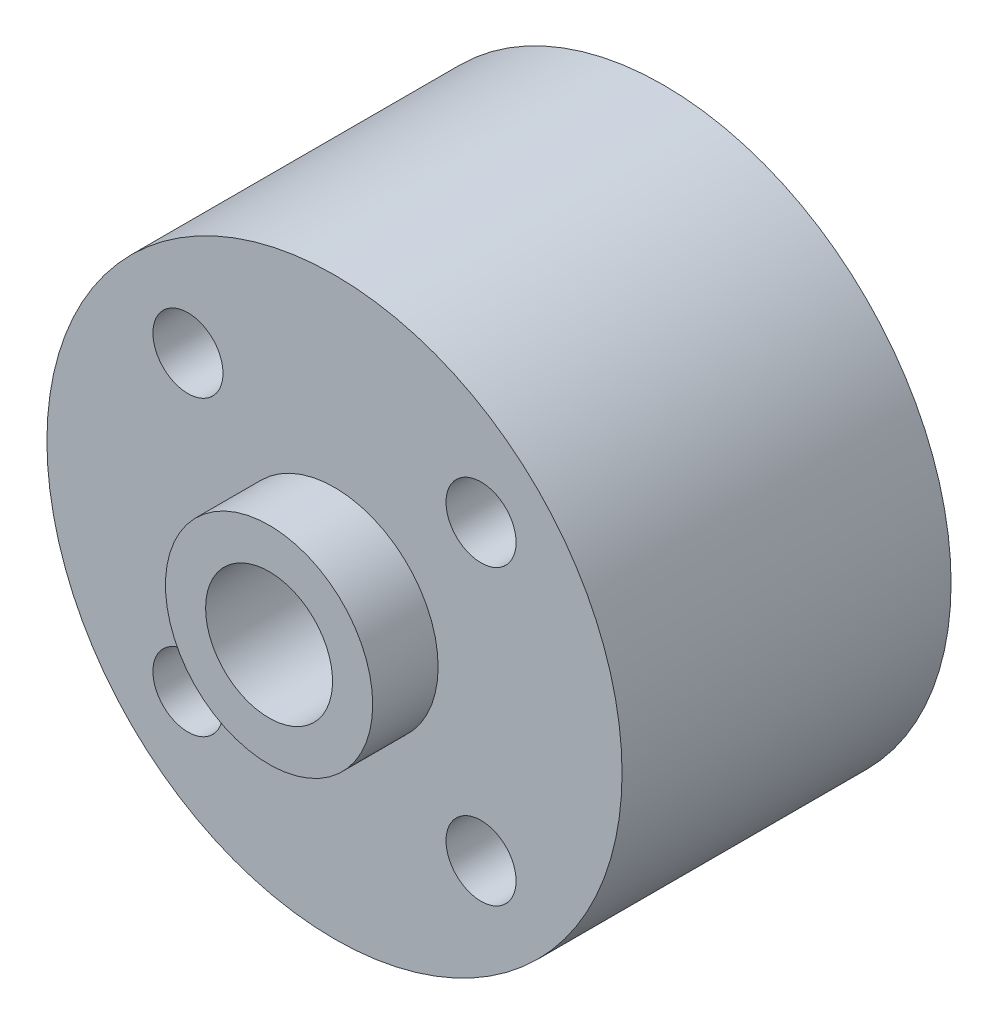
ISO-10303-21;
HEADER;
FILE_DESCRIPTION(('STEP AP214'),'2;1');
FILE_NAME('part.step','',(''),(''),'','','');
FILE_SCHEMA(('AUTOMOTIVE_DESIGN { 1 0 10303 214 1 1 1 1 }'));
ENDSEC;
DATA;
#1=APPLICATION_CONTEXT('core data for automotive mechanical design processes');
#2=APPLICATION_PROTOCOL_DEFINITION('international standard','automotive_design',2000,#1);
#3=PRODUCT_CONTEXT('',#1,'mechanical');
#4=PRODUCT('Part','Part','',(#3));
#5=PRODUCT_RELATED_PRODUCT_CATEGORY('part','',(#4));
#6=PRODUCT_DEFINITION_FORMATION('','',#4);
#7=PRODUCT_DEFINITION_CONTEXT('part definition',#1,'design');
#8=PRODUCT_DEFINITION('design','',#6,#7);
#9=PRODUCT_DEFINITION_SHAPE('','',#8);
#10=(LENGTH_UNIT() NAMED_UNIT(*) SI_UNIT(.MILLI.,.METRE.));
#11=(NAMED_UNIT(*) PLANE_ANGLE_UNIT() SI_UNIT($,.RADIAN.));
#12=(NAMED_UNIT(*) SI_UNIT($,.STERADIAN.) SOLID_ANGLE_UNIT());
#13=UNCERTAINTY_MEASURE_WITH_UNIT(LENGTH_MEASURE(1.E-05),#10,'distance_accuracy_value','');
#14=(GEOMETRIC_REPRESENTATION_CONTEXT(3) GLOBAL_UNCERTAINTY_ASSIGNED_CONTEXT((#13)) GLOBAL_UNIT_ASSIGNED_CONTEXT((#10,
#11,#12)) REPRESENTATION_CONTEXT('',''));
#15=CARTESIAN_POINT('',(0.,0.,0.));
#16=DIRECTION('',(0.,0.,1.));
#17=DIRECTION('',(1.,0.,0.));
#18=AXIS2_PLACEMENT_3D('',#15,#16,#17);
#19=CARTESIAN_POINT('',(0.,0.,10.65));
#20=DIRECTION('',(0.,0.,-1.));
#21=DIRECTION('',(-1.,0.,0.));
#22=AXIS2_PLACEMENT_3D('',#19,#20,#21);
#23=CYLINDRICAL_SURFACE('',#22,2.45);
#24=CARTESIAN_POINT('',(0.,0.,8.875));
#25=DIRECTION('',(0.,0.,-1.));
#26=DIRECTION('',(-1.,0.,0.));
#27=AXIS2_PLACEMENT_3D('',#24,#25,#26);
#28=CIRCLE('',#27,2.45);
#29=CARTESIAN_POINT('',(-2.45,0.,8.875));
#30=VERTEX_POINT('',#29);
#31=EDGE_CURVE('E62',#30,#30,#28,.T.);
#32=ORIENTED_EDGE('',*,*,#31,.F.);
#33=EDGE_LOOP('',(#32));
#34=FACE_BOUND('',#33,.T.);
#35=CARTESIAN_POINT('',(0.,0.,-8.875));
#36=DIRECTION('',(0.,0.,-1.));
#37=DIRECTION('',(-1.,0.,0.));
#38=AXIS2_PLACEMENT_3D('',#35,#36,#37);
#39=CIRCLE('',#38,2.45);
#40=CARTESIAN_POINT('',(-2.45,0.,-8.875));
#41=VERTEX_POINT('',#40);
#42=EDGE_CURVE('E16',#41,#41,#39,.T.);
#43=ORIENTED_EDGE('',*,*,#42,.T.);
#44=EDGE_LOOP('',(#43));
#45=FACE_BOUND('',#44,.T.);
#46=ADVANCED_FACE('F13',(#34,#45),#23,.F.);
#47=CARTESIAN_POINT('',(0.,0.,-8.875));
#48=DIRECTION('',(0.,0.,1.));
#49=DIRECTION('',(1.,0.,0.));
#50=AXIS2_PLACEMENT_3D('',#47,#48,#49);
#51=PLANE('',#50);
#52=ORIENTED_EDGE('',*,*,#42,.F.);
#53=EDGE_LOOP('',(#52));
#54=FACE_BOUND('',#53,.T.);
#55=CARTESIAN_POINT('',(0.,0.,-8.875));
#56=DIRECTION('',(0.,0.,1.));
#57=DIRECTION('',(1.,0.,0.));
#58=AXIS2_PLACEMENT_3D('',#55,#56,#57);
#59=CIRCLE('',#58,4.);
#60=CARTESIAN_POINT('',(4.,0.,-8.875));
#61=VERTEX_POINT('',#60);
#62=EDGE_CURVE('E60',#61,#61,#59,.T.);
#63=ORIENTED_EDGE('',*,*,#62,.F.);
#64=EDGE_LOOP('',(#63));
#65=FACE_BOUND('',#64,.T.);
#66=ADVANCED_FACE('F70',(#54,#65),#51,.F.);
#67=CARTESIAN_POINT('',(0.,0.,8.875));
#68=DIRECTION('',(0.,0.,1.));
#69=DIRECTION('',(1.,0.,0.));
#70=AXIS2_PLACEMENT_3D('',#67,#68,#69);
#71=PLANE('',#70);
#72=ORIENTED_EDGE('',*,*,#31,.T.);
#73=EDGE_LOOP('',(#72));
#74=FACE_BOUND('',#73,.T.);
#75=CARTESIAN_POINT('',(0.,0.,8.875));
#76=DIRECTION('',(0.,0.,1.));
#77=DIRECTION('',(1.,0.,0.));
#78=AXIS2_PLACEMENT_3D('',#75,#76,#77);
#79=CIRCLE('',#78,4.);
#80=CARTESIAN_POINT('',(4.,0.,8.875));
#81=VERTEX_POINT('',#80);
#82=EDGE_CURVE('E57',#81,#81,#79,.F.);
#83=ORIENTED_EDGE('',*,*,#82,.F.);
#84=EDGE_LOOP('',(#83));
#85=FACE_BOUND('',#84,.T.);
#86=ADVANCED_FACE('F73',(#74,#85),#71,.T.);
#87=CARTESIAN_POINT('',(0.,0.,-8.875));
#88=DIRECTION('',(0.,0.,1.));
#89=DIRECTION('',(1.,0.,0.));
#90=AXIS2_PLACEMENT_3D('',#87,#88,#89);
#91=CYLINDRICAL_SURFACE('',#90,4.);
#92=ORIENTED_EDGE('',*,*,#62,.T.);
#93=EDGE_LOOP('',(#92));
#94=FACE_BOUND('',#93,.T.);
#95=CARTESIAN_POINT('',(0.,0.,-6.35));
#96=DIRECTION('',(0.,0.,1.));
#97=DIRECTION('',(1.,0.,0.));
#98=AXIS2_PLACEMENT_3D('',#95,#96,#97);
#99=CIRCLE('',#98,4.);
#100=CARTESIAN_POINT('',(4.,0.,-6.35));
#101=VERTEX_POINT('',#100);
#102=EDGE_CURVE('E54',#101,#101,#99,.F.);
#103=ORIENTED_EDGE('',*,*,#102,.T.);
#104=EDGE_LOOP('',(#103));
#105=FACE_BOUND('',#104,.T.);
#106=ADVANCED_FACE('F76',(#94,#105),#91,.T.);
#107=CARTESIAN_POINT('',(0.,0.,-8.875));
#108=DIRECTION('',(0.,0.,1.));
#109=DIRECTION('',(1.,0.,0.));
#110=AXIS2_PLACEMENT_3D('',#107,#108,#109);
#111=CYLINDRICAL_SURFACE('',#110,4.);
#112=ORIENTED_EDGE('',*,*,#82,.T.);
#113=EDGE_LOOP('',(#112));
#114=FACE_BOUND('',#113,.T.);
#115=CARTESIAN_POINT('',(0.,0.,6.35));
#116=DIRECTION('',(0.,0.,1.));
#117=DIRECTION('',(1.,0.,0.));
#118=AXIS2_PLACEMENT_3D('',#115,#116,#117);
#119=CIRCLE('',#118,4.);
#120=CARTESIAN_POINT('',(4.,0.,6.35));
#121=VERTEX_POINT('',#120);
#122=EDGE_CURVE('E39',#121,#121,#119,.F.);
#123=ORIENTED_EDGE('',*,*,#122,.F.);
#124=EDGE_LOOP('',(#123));
#125=FACE_BOUND('',#124,.T.);
#126=ADVANCED_FACE('F79',(#114,#125),#111,.T.);
#127=CARTESIAN_POINT('',(5.65685424949239,5.65685424949238,10.65));
#128=DIRECTION('',(0.,0.,1.));
#129=DIRECTION('',(1.,0.,0.));
#130=AXIS2_PLACEMENT_3D('',#127,#128,#129);
#131=CYLINDRICAL_SURFACE('',#130,1.3525);
#132=CARTESIAN_POINT('',(5.65685424949239,5.65685424949238,-6.35));
#133=DIRECTION('',(0.,0.,1.));
#134=DIRECTION('',(1.,0.,0.));
#135=AXIS2_PLACEMENT_3D('',#132,#133,#134);
#136=CIRCLE('',#135,1.3525);
#137=CARTESIAN_POINT('',(7.00935424949239,5.65685424949238,-6.35));
#138=VERTEX_POINT('',#137);
#139=EDGE_CURVE('E51',#138,#138,#136,.F.);
#140=ORIENTED_EDGE('',*,*,#139,.T.);
#141=EDGE_LOOP('',(#140));
#142=FACE_BOUND('',#141,.T.);
#143=CARTESIAN_POINT('',(5.65685424949239,5.65685424949238,6.35));
#144=DIRECTION('',(0.,0.,1.));
#145=DIRECTION('',(1.,0.,0.));
#146=AXIS2_PLACEMENT_3D('',#143,#144,#145);
#147=CIRCLE('',#146,1.3525);
#148=CARTESIAN_POINT('',(7.00935424949239,5.65685424949238,6.35));
#149=VERTEX_POINT('',#148);
#150=EDGE_CURVE('E36',#149,#149,#147,.F.);
#151=ORIENTED_EDGE('',*,*,#150,.F.);
#152=EDGE_LOOP('',(#151));
#153=FACE_BOUND('',#152,.T.);
#154=ADVANCED_FACE('F112',(#142,#153),#131,.F.);
#155=CARTESIAN_POINT('',(-5.65685424949237,5.65685424949238,10.65));
#156=DIRECTION('',(0.,0.,1.));
#157=DIRECTION('',(1.,0.,0.));
#158=AXIS2_PLACEMENT_3D('',#155,#156,#157);
#159=CYLINDRICAL_SURFACE('',#158,1.3525);
#160=CARTESIAN_POINT('',(-5.65685424949237,5.65685424949238,-6.35));
#161=DIRECTION('',(0.,0.,1.));
#162=DIRECTION('',(1.,0.,0.));
#163=AXIS2_PLACEMENT_3D('',#160,#161,#162);
#164=CIRCLE('',#163,1.3525);
#165=CARTESIAN_POINT('',(-4.30435424949237,5.65685424949238,-6.35));
#166=VERTEX_POINT('',#165);
#167=EDGE_CURVE('E48',#166,#166,#164,.F.);
#168=ORIENTED_EDGE('',*,*,#167,.T.);
#169=EDGE_LOOP('',(#168));
#170=FACE_BOUND('',#169,.T.);
#171=CARTESIAN_POINT('',(-5.65685424949237,5.65685424949238,6.35));
#172=DIRECTION('',(0.,0.,1.));
#173=DIRECTION('',(1.,0.,0.));
#174=AXIS2_PLACEMENT_3D('',#171,#172,#173);
#175=CIRCLE('',#174,1.3525);
#176=CARTESIAN_POINT('',(-4.30435424949237,5.65685424949238,6.35));
#177=VERTEX_POINT('',#176);
#178=EDGE_CURVE('E33',#177,#177,#175,.F.);
#179=ORIENTED_EDGE('',*,*,#178,.F.);
#180=EDGE_LOOP('',(#179));
#181=FACE_BOUND('',#180,.T.);
#182=ADVANCED_FACE('F108',(#170,#181),#159,.F.);
#183=CARTESIAN_POINT('',(-5.65685424949237,-5.65685424949238,10.65));
#184=DIRECTION('',(0.,0.,1.));
#185=DIRECTION('',(1.,0.,0.));
#186=AXIS2_PLACEMENT_3D('',#183,#184,#185);
#187=CYLINDRICAL_SURFACE('',#186,1.3525);
#188=CARTESIAN_POINT('',(-5.65685424949237,-5.65685424949238,-6.35));
#189=DIRECTION('',(0.,0.,1.));
#190=DIRECTION('',(1.,0.,0.));
#191=AXIS2_PLACEMENT_3D('',#188,#189,#190);
#192=CIRCLE('',#191,1.3525);
#193=CARTESIAN_POINT('',(-4.30435424949237,-5.65685424949238,-6.35));
#194=VERTEX_POINT('',#193);
#195=EDGE_CURVE('E45',#194,#194,#192,.F.);
#196=ORIENTED_EDGE('',*,*,#195,.T.);
#197=EDGE_LOOP('',(#196));
#198=FACE_BOUND('',#197,.T.);
#199=CARTESIAN_POINT('',(-5.65685424949237,-5.65685424949238,6.35));
#200=DIRECTION('',(0.,0.,1.));
#201=DIRECTION('',(1.,0.,0.));
#202=AXIS2_PLACEMENT_3D('',#199,#200,#201);
#203=CIRCLE('',#202,1.3525);
#204=CARTESIAN_POINT('',(-4.30435424949237,-5.65685424949238,6.35));
#205=VERTEX_POINT('',#204);
#206=EDGE_CURVE('E30',#205,#205,#203,.F.);
#207=ORIENTED_EDGE('',*,*,#206,.F.);
#208=EDGE_LOOP('',(#207));
#209=FACE_BOUND('',#208,.T.);
#210=ADVANCED_FACE('F104',(#198,#209),#187,.F.);
#211=CARTESIAN_POINT('',(5.65685424949239,-5.65685424949238,10.65));
#212=DIRECTION('',(0.,0.,1.));
#213=DIRECTION('',(1.,0.,0.));
#214=AXIS2_PLACEMENT_3D('',#211,#212,#213);
#215=CYLINDRICAL_SURFACE('',#214,1.3525);
#216=CARTESIAN_POINT('',(5.65685424949239,-5.65685424949238,-6.35));
#217=DIRECTION('',(0.,0.,1.));
#218=DIRECTION('',(1.,0.,0.));
#219=AXIS2_PLACEMENT_3D('',#216,#217,#218);
#220=CIRCLE('',#219,1.3525);
#221=CARTESIAN_POINT('',(7.00935424949239,-5.65685424949238,-6.35));
#222=VERTEX_POINT('',#221);
#223=EDGE_CURVE('E42',#222,#222,#220,.F.);
#224=ORIENTED_EDGE('',*,*,#223,.T.);
#225=EDGE_LOOP('',(#224));
#226=FACE_BOUND('',#225,.T.);
#227=CARTESIAN_POINT('',(5.65685424949239,-5.65685424949238,6.35));
#228=DIRECTION('',(0.,0.,1.));
#229=DIRECTION('',(1.,0.,0.));
#230=AXIS2_PLACEMENT_3D('',#227,#228,#229);
#231=CIRCLE('',#230,1.3525);
#232=CARTESIAN_POINT('',(7.00935424949239,-5.65685424949238,6.35));
#233=VERTEX_POINT('',#232);
#234=EDGE_CURVE('E25',#233,#233,#231,.F.);
#235=ORIENTED_EDGE('',*,*,#234,.F.);
#236=EDGE_LOOP('',(#235));
#237=FACE_BOUND('',#236,.T.);
#238=ADVANCED_FACE('F87',(#226,#237),#215,.F.);
#239=CARTESIAN_POINT('',(0.,0.,-6.35));
#240=DIRECTION('',(0.,0.,1.));
#241=DIRECTION('',(1.,0.,0.));
#242=AXIS2_PLACEMENT_3D('',#239,#240,#241);
#243=PLANE('',#242);
#244=ORIENTED_EDGE('',*,*,#223,.F.);
#245=EDGE_LOOP('',(#244));
#246=FACE_BOUND('',#245,.T.);
#247=ORIENTED_EDGE('',*,*,#195,.F.);
#248=EDGE_LOOP('',(#247));
#249=FACE_BOUND('',#248,.T.);
#250=ORIENTED_EDGE('',*,*,#167,.F.);
#251=EDGE_LOOP('',(#250));
#252=FACE_BOUND('',#251,.T.);
#253=ORIENTED_EDGE('',*,*,#139,.F.);
#254=EDGE_LOOP('',(#253));
#255=FACE_BOUND('',#254,.T.);
#256=ORIENTED_EDGE('',*,*,#102,.F.);
#257=EDGE_LOOP('',(#256));
#258=FACE_BOUND('',#257,.T.);
#259=CARTESIAN_POINT('',(0.,0.,-6.35));
#260=DIRECTION('',(0.,0.,1.));
#261=DIRECTION('',(1.,0.,0.));
#262=AXIS2_PLACEMENT_3D('',#259,#260,#261);
#263=CIRCLE('',#262,11.1);
#264=CARTESIAN_POINT('',(11.1,0.,-6.35));
#265=VERTEX_POINT('',#264);
#266=EDGE_CURVE('E20',#265,#265,#263,.T.);
#267=ORIENTED_EDGE('',*,*,#266,.F.);
#268=EDGE_LOOP('',(#267));
#269=FACE_BOUND('',#268,.T.);
#270=ADVANCED_FACE('F83',(#246,#249,#252,#255,#258,#269),#243,.F.);
#271=CARTESIAN_POINT('',(0.,0.,6.35));
#272=DIRECTION('',(0.,0.,1.));
#273=DIRECTION('',(1.,0.,0.));
#274=AXIS2_PLACEMENT_3D('',#271,#272,#273);
#275=PLANE('',#274);
#276=ORIENTED_EDGE('',*,*,#234,.T.);
#277=EDGE_LOOP('',(#276));
#278=FACE_BOUND('',#277,.T.);
#279=ORIENTED_EDGE('',*,*,#206,.T.);
#280=EDGE_LOOP('',(#279));
#281=FACE_BOUND('',#280,.T.);
#282=ORIENTED_EDGE('',*,*,#178,.T.);
#283=EDGE_LOOP('',(#282));
#284=FACE_BOUND('',#283,.T.);
#285=ORIENTED_EDGE('',*,*,#150,.T.);
#286=EDGE_LOOP('',(#285));
#287=FACE_BOUND('',#286,.T.);
#288=ORIENTED_EDGE('',*,*,#122,.T.);
#289=EDGE_LOOP('',(#288));
#290=FACE_BOUND('',#289,.T.);
#291=CARTESIAN_POINT('',(0.,0.,6.35));
#292=DIRECTION('',(0.,0.,1.));
#293=DIRECTION('',(1.,0.,0.));
#294=AXIS2_PLACEMENT_3D('',#291,#292,#293);
#295=CIRCLE('',#294,11.1);
#296=CARTESIAN_POINT('',(11.1,0.,6.35));
#297=VERTEX_POINT('',#296);
#298=EDGE_CURVE('E9',#297,#297,#295,.F.);
#299=ORIENTED_EDGE('',*,*,#298,.F.);
#300=EDGE_LOOP('',(#299));
#301=FACE_BOUND('',#300,.T.);
#302=ADVANCED_FACE('F86',(#278,#281,#284,#287,#290,#301),#275,.T.);
#303=CARTESIAN_POINT('',(0.,0.,6.35));
#304=DIRECTION('',(0.,0.,1.));
#305=DIRECTION('',(1.,0.,0.));
#306=AXIS2_PLACEMENT_3D('',#303,#304,#305);
#307=CYLINDRICAL_SURFACE('',#306,11.1);
#308=ORIENTED_EDGE('',*,*,#266,.T.);
#309=EDGE_LOOP('',(#308));
#310=FACE_BOUND('',#309,.T.);
#311=ORIENTED_EDGE('',*,*,#298,.T.);
#312=EDGE_LOOP('',(#311));
#313=FACE_BOUND('',#312,.T.);
#314=ADVANCED_FACE('F92',(#310,#313),#307,.T.);
#315=CLOSED_SHELL('',(#46,#66,#86,#106,#126,#154,#182,#210,#238,#270,#302,#314));
#316=MANIFOLD_SOLID_BREP('B1',#315);
#317=ADVANCED_BREP_SHAPE_REPRESENTATION('',(#18,#316),#14);
#318=SHAPE_DEFINITION_REPRESENTATION(#9,#317);
ENDSEC;
END-ISO-10303-21;
